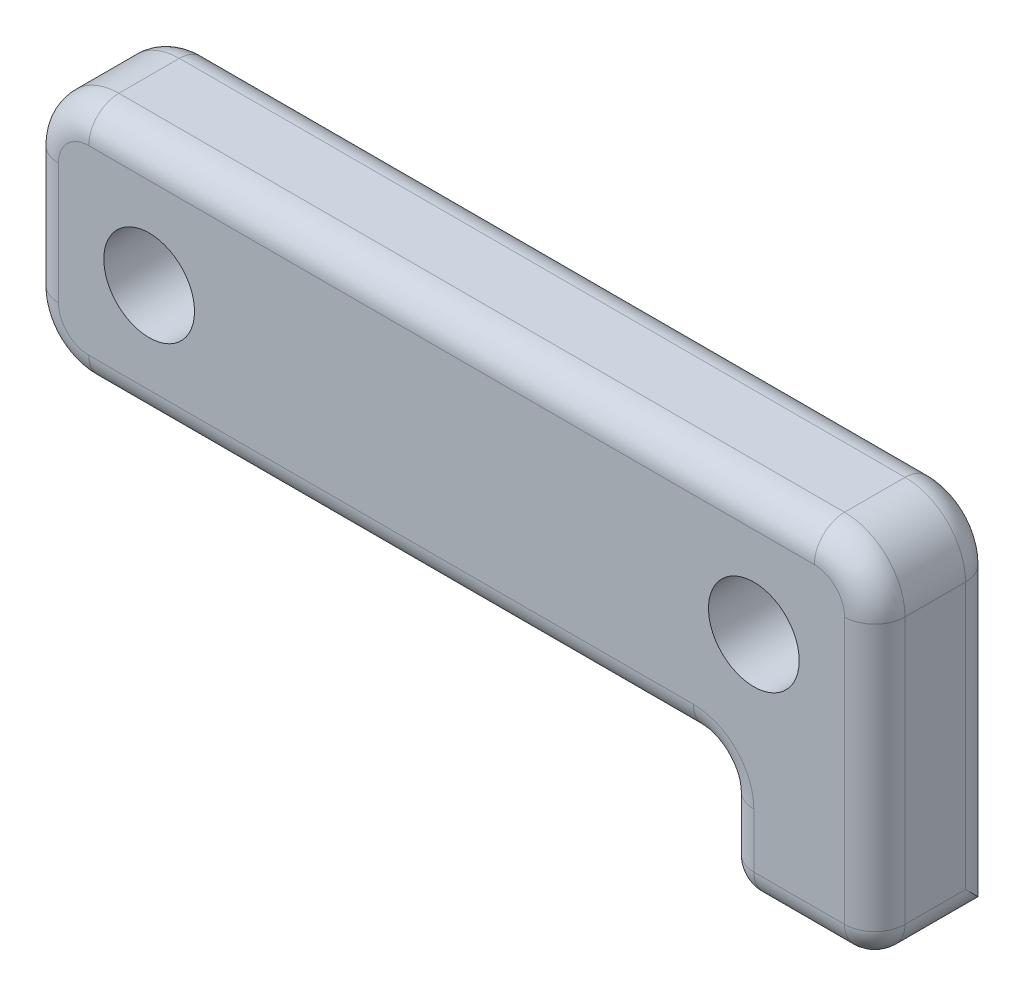
ISO-10303-21;
HEADER;
FILE_DESCRIPTION(('STEP AP214'),'2;1');
FILE_NAME('part.step','',(''),(''),'','','');
FILE_SCHEMA(('AUTOMOTIVE_DESIGN { 1 0 10303 214 1 1 1 1 }'));
ENDSEC;
DATA;
#1=APPLICATION_CONTEXT('core data for automotive mechanical design processes');
#2=APPLICATION_PROTOCOL_DEFINITION('international standard','automotive_design',2000,#1);
#3=PRODUCT_CONTEXT('',#1,'mechanical');
#4=PRODUCT('Part','Part','',(#3));
#5=PRODUCT_RELATED_PRODUCT_CATEGORY('part','',(#4));
#6=PRODUCT_DEFINITION_FORMATION('','',#4);
#7=PRODUCT_DEFINITION_CONTEXT('part definition',#1,'design');
#8=PRODUCT_DEFINITION('design','',#6,#7);
#9=PRODUCT_DEFINITION_SHAPE('','',#8);
#10=(LENGTH_UNIT() NAMED_UNIT(*) SI_UNIT(.MILLI.,.METRE.));
#11=(NAMED_UNIT(*) PLANE_ANGLE_UNIT() SI_UNIT($,.RADIAN.));
#12=(NAMED_UNIT(*) SI_UNIT($,.STERADIAN.) SOLID_ANGLE_UNIT());
#13=UNCERTAINTY_MEASURE_WITH_UNIT(LENGTH_MEASURE(1.E-05),#10,'distance_accuracy_value','');
#14=(GEOMETRIC_REPRESENTATION_CONTEXT(3) GLOBAL_UNCERTAINTY_ASSIGNED_CONTEXT((#13)) GLOBAL_UNIT_ASSIGNED_CONTEXT((#10,
#11,#12)) REPRESENTATION_CONTEXT('',''));
#15=CARTESIAN_POINT('',(0.,0.,0.));
#16=DIRECTION('',(0.,0.,1.));
#17=DIRECTION('',(1.,0.,0.));
#18=AXIS2_PLACEMENT_3D('',#15,#16,#17);
#19=CARTESIAN_POINT('',(1.11353145720165,-7.80553195876444,2.));
#20=DIRECTION('',(0.,-1.,0.));
#21=DIRECTION('',(1.,0.,0.));
#22=AXIS2_PLACEMENT_3D('',#19,#20,#21);
#23=PLANE('',#22);
#24=DIRECTION('',(-1.,0.,0.));
#25=VECTOR('',#24,1.);
#26=CARTESIAN_POINT('',(1.11353145720165,-7.80553195876444,-2.));
#27=LINE('',#26,#25);
#28=CARTESIAN_POINT('',(13.,-7.80553195876444,-2.));
#29=VERTEX_POINT('',#28);
#30=CARTESIAN_POINT('',(12.3,-7.80553195876443,-2.));
#31=VERTEX_POINT('',#30);
#32=EDGE_CURVE('E229',#29,#31,#27,.T.);
#33=ORIENTED_EDGE('',*,*,#32,.F.);
#34=DIRECTION('',(0.,0.,-1.));
#35=VECTOR('',#34,1.);
#36=CARTESIAN_POINT('',(13.,-7.80553195876444,2.));
#37=LINE('',#36,#35);
#38=CARTESIAN_POINT('',(13.,-7.80553195876444,1.));
#39=VERTEX_POINT('',#38);
#40=EDGE_CURVE('E343',#29,#39,#37,.F.);
#41=ORIENTED_EDGE('',*,*,#40,.T.);
#42=DIRECTION('',(-1.,0.,0.));
#43=VECTOR('',#42,1.);
#44=CARTESIAN_POINT('',(1.11353145720165,-7.80553195876444,1.));
#45=LINE('',#44,#43);
#46=CARTESIAN_POINT('',(10.,-7.80553195876444,1.));
#47=VERTEX_POINT('',#46);
#48=EDGE_CURVE('E341',#39,#47,#45,.T.);
#49=ORIENTED_EDGE('',*,*,#48,.T.);
#50=DIRECTION('',(0.,0.,-1.));
#51=VECTOR('',#50,1.);
#52=CARTESIAN_POINT('',(10.,-7.80553195876444,2.));
#53=LINE('',#52,#51);
#54=CARTESIAN_POINT('',(9.99999999999999,-7.80553195876444,-2.));
#55=VERTEX_POINT('',#54);
#56=EDGE_CURVE('E339',#47,#55,#53,.T.);
#57=ORIENTED_EDGE('',*,*,#56,.T.);
#58=CARTESIAN_POINT('',(11.7,-7.80553195876443,-2.));
#59=VERTEX_POINT('',#58);
#60=EDGE_CURVE('E225',#59,#55,#27,.T.);
#61=ORIENTED_EDGE('',*,*,#60,.F.);
#62=DIRECTION('',(0.,0.,-1.));
#63=VECTOR('',#62,1.);
#64=CARTESIAN_POINT('',(11.7,-7.80553195876443,-1.));
#65=LINE('',#64,#63);
#66=CARTESIAN_POINT('',(11.7,-7.80553195876443,-1.));
#67=VERTEX_POINT('',#66);
#68=EDGE_CURVE('E226',#67,#59,#65,.T.);
#69=ORIENTED_EDGE('',*,*,#68,.F.);
#70=DIRECTION('',(-1.,0.,0.));
#71=VECTOR('',#70,1.);
#72=CARTESIAN_POINT('',(1.11353145720165,-7.80553195876444,-1.));
#73=LINE('',#72,#71);
#74=CARTESIAN_POINT('',(12.3,-7.80553195876443,-1.));
#75=VERTEX_POINT('',#74);
#76=EDGE_CURVE('E208',#75,#67,#73,.T.);
#77=ORIENTED_EDGE('',*,*,#76,.F.);
#78=DIRECTION('',(0.,0.,-1.));
#79=VECTOR('',#78,1.);
#80=CARTESIAN_POINT('',(12.3,-7.80553195876443,-1.));
#81=LINE('',#80,#79);
#82=EDGE_CURVE('E231',#75,#31,#81,.T.);
#83=ORIENTED_EDGE('',*,*,#82,.T.);
#84=EDGE_LOOP('',(#33,#41,#49,#57,#61,#69,#77,#83));
#85=FACE_BOUND('',#84,.T.);
#86=ADVANCED_FACE('F34',(#85),#23,.T.);
#87=CARTESIAN_POINT('',(1.11353145720165,-25.2920568815977,-2.));
#88=DIRECTION('',(0.,0.,1.));
#89=DIRECTION('',(1.,0.,0.));
#90=AXIS2_PLACEMENT_3D('',#87,#88,#89);
#91=PLANE('',#90);
#92=ORIENTED_EDGE('',*,*,#60,.T.);
#93=DIRECTION('',(0.,1.,0.));
#94=VECTOR('',#93,1.);
#95=CARTESIAN_POINT('',(10.,-4.,-2.));
#96=LINE('',#95,#94);
#97=CARTESIAN_POINT('',(10.,-5.,-2.));
#98=VERTEX_POINT('',#97);
#99=EDGE_CURVE('E278',#55,#98,#96,.T.);
#100=ORIENTED_EDGE('',*,*,#99,.T.);
#101=CARTESIAN_POINT('',(8.,-5.,-2.));
#102=DIRECTION('',(0.,0.,1.));
#103=DIRECTION('',(1.,0.,0.));
#104=AXIS2_PLACEMENT_3D('',#101,#102,#103);
#105=CIRCLE('',#104,2.);
#106=CARTESIAN_POINT('',(8.,-3.,-2.));
#107=VERTEX_POINT('',#106);
#108=EDGE_CURVE('E275',#107,#98,#105,.F.);
#109=ORIENTED_EDGE('',*,*,#108,.F.);
#110=DIRECTION('',(-1.,0.,0.));
#111=VECTOR('',#110,1.);
#112=CARTESIAN_POINT('',(-12.,-3.,-2.));
#113=LINE('',#112,#111);
#114=CARTESIAN_POINT('',(-12.,-3.,-2.));
#115=VERTEX_POINT('',#114);
#116=EDGE_CURVE('E261',#107,#115,#113,.T.);
#117=ORIENTED_EDGE('',*,*,#116,.T.);
#118=CARTESIAN_POINT('',(-12.,-2.,-2.));
#119=DIRECTION('',(0.,0.,1.));
#120=DIRECTION('',(1.,0.,0.));
#121=AXIS2_PLACEMENT_3D('',#118,#119,#120);
#122=CIRCLE('',#121,1.);
#123=CARTESIAN_POINT('',(-13.,-2.,-2.));
#124=VERTEX_POINT('',#123);
#125=EDGE_CURVE('E263',#115,#124,#122,.F.);
#126=ORIENTED_EDGE('',*,*,#125,.T.);
#127=DIRECTION('',(0.,1.,0.));
#128=VECTOR('',#127,1.);
#129=CARTESIAN_POINT('',(-13.,2.,-2.));
#130=LINE('',#129,#128);
#131=CARTESIAN_POINT('',(-13.,2.,-2.));
#132=VERTEX_POINT('',#131);
#133=EDGE_CURVE('E265',#124,#132,#130,.T.);
#134=ORIENTED_EDGE('',*,*,#133,.T.);
#135=CARTESIAN_POINT('',(-12.,2.,-2.));
#136=DIRECTION('',(0.,0.,1.));
#137=DIRECTION('',(1.,0.,0.));
#138=AXIS2_PLACEMENT_3D('',#135,#136,#137);
#139=CIRCLE('',#138,1.);
#140=CARTESIAN_POINT('',(-12.,3.,-2.));
#141=VERTEX_POINT('',#140);
#142=EDGE_CURVE('E267',#132,#141,#139,.F.);
#143=ORIENTED_EDGE('',*,*,#142,.T.);
#144=DIRECTION('',(1.,0.,0.));
#145=VECTOR('',#144,1.);
#146=CARTESIAN_POINT('',(12.,3.,-2.));
#147=LINE('',#146,#145);
#148=CARTESIAN_POINT('',(12.,3.,-2.));
#149=VERTEX_POINT('',#148);
#150=EDGE_CURVE('E269',#141,#149,#147,.T.);
#151=ORIENTED_EDGE('',*,*,#150,.T.);
#152=CARTESIAN_POINT('',(12.,2.,-2.));
#153=DIRECTION('',(0.,0.,1.));
#154=DIRECTION('',(1.,0.,0.));
#155=AXIS2_PLACEMENT_3D('',#152,#153,#154);
#156=CIRCLE('',#155,0.999999999999999);
#157=CARTESIAN_POINT('',(13.,2.,-2.));
#158=VERTEX_POINT('',#157);
#159=EDGE_CURVE('E271',#149,#158,#156,.F.);
#160=ORIENTED_EDGE('',*,*,#159,.T.);
#161=DIRECTION('',(0.,-1.,0.));
#162=VECTOR('',#161,1.);
#163=CARTESIAN_POINT('',(13.,-7.80553195876443,-2.));
#164=LINE('',#163,#162);
#165=EDGE_CURVE('E273',#158,#29,#164,.T.);
#166=ORIENTED_EDGE('',*,*,#165,.T.);
#167=ORIENTED_EDGE('',*,*,#32,.T.);
#168=DIRECTION('',(0.,-1.,0.));
#169=VECTOR('',#168,1.);
#170=CARTESIAN_POINT('',(12.3,-25.2920568815977,-2.));
#171=LINE('',#170,#169);
#172=CARTESIAN_POINT('',(12.3,0.,-2.));
#173=VERTEX_POINT('',#172);
#174=EDGE_CURVE('E220',#173,#31,#171,.T.);
#175=ORIENTED_EDGE('',*,*,#174,.F.);
#176=CARTESIAN_POINT('',(10.,0.,-2.));
#177=DIRECTION('',(0.,0.,1.));
#178=DIRECTION('',(1.,0.,0.));
#179=AXIS2_PLACEMENT_3D('',#176,#177,#178);
#180=CIRCLE('',#179,2.3);
#181=CARTESIAN_POINT('',(11.7,-1.54919333848296,-2.));
#182=VERTEX_POINT('',#181);
#183=EDGE_CURVE('E421',#173,#182,#180,.T.);
#184=ORIENTED_EDGE('',*,*,#183,.T.);
#185=DIRECTION('',(0.,-1.,0.));
#186=VECTOR('',#185,1.);
#187=CARTESIAN_POINT('',(11.7,-25.2920568815977,-2.));
#188=LINE('',#187,#186);
#189=EDGE_CURVE('E224',#182,#59,#188,.T.);
#190=ORIENTED_EDGE('',*,*,#189,.T.);
#191=EDGE_LOOP('',(#92,#100,#109,#117,#126,#134,#143,#151,#160,#166,#167,#175,#184,#190));
#192=FACE_BOUND('',#191,.T.);
#193=CARTESIAN_POINT('',(-10.,0.,-2.));
#194=DIRECTION('',(0.,0.,1.));
#195=DIRECTION('',(1.,0.,0.));
#196=AXIS2_PLACEMENT_3D('',#193,#194,#195);
#197=CIRCLE('',#196,1.5);
#198=CARTESIAN_POINT('',(-8.5,0.,-2.));
#199=VERTEX_POINT('',#198);
#200=EDGE_CURVE('E239',#199,#199,#197,.T.);
#201=ORIENTED_EDGE('',*,*,#200,.T.);
#202=EDGE_LOOP('',(#201));
#203=FACE_BOUND('',#202,.T.);
#204=ADVANCED_FACE('F465',(#192,#203),#91,.F.);
#205=CARTESIAN_POINT('',(1.11353145720165,-4.,2.));
#206=DIRECTION('',(0.,-1.,0.));
#207=DIRECTION('',(1.,0.,0.));
#208=AXIS2_PLACEMENT_3D('',#205,#206,#207);
#209=PLANE('',#208);
#210=DIRECTION('',(0.,0.,-1.));
#211=VECTOR('',#210,1.);
#212=CARTESIAN_POINT('',(-12.,-4.,2.));
#213=LINE('',#212,#211);
#214=CARTESIAN_POINT('',(-12.,-4.,1.));
#215=VERTEX_POINT('',#214);
#216=CARTESIAN_POINT('',(-12.,-4.,-1.));
#217=VERTEX_POINT('',#216);
#218=EDGE_CURVE('E241',#215,#217,#213,.T.);
#219=ORIENTED_EDGE('',*,*,#218,.T.);
#220=DIRECTION('',(-1.,0.,0.));
#221=VECTOR('',#220,1.);
#222=CARTESIAN_POINT('',(9.,-4.,-1.));
#223=LINE('',#222,#221);
#224=CARTESIAN_POINT('',(8.,-4.,-1.));
#225=VERTEX_POINT('',#224);
#226=EDGE_CURVE('E11',#217,#225,#223,.F.);
#227=ORIENTED_EDGE('',*,*,#226,.T.);
#228=DIRECTION('',(0.,0.,-1.));
#229=VECTOR('',#228,1.);
#230=CARTESIAN_POINT('',(8.,-4.,2.));
#231=LINE('',#230,#229);
#232=CARTESIAN_POINT('',(8.,-4.,1.));
#233=VERTEX_POINT('',#232);
#234=EDGE_CURVE('E50',#225,#233,#231,.F.);
#235=ORIENTED_EDGE('',*,*,#234,.T.);
#236=DIRECTION('',(-1.,0.,0.));
#237=VECTOR('',#236,1.);
#238=CARTESIAN_POINT('',(1.11353145720165,-4.,1.));
#239=LINE('',#238,#237);
#240=EDGE_CURVE('E43',#233,#215,#239,.T.);
#241=ORIENTED_EDGE('',*,*,#240,.T.);
#242=EDGE_LOOP('',(#219,#227,#235,#241));
#243=FACE_BOUND('',#242,.T.);
#244=ADVANCED_FACE('F470',(#243),#209,.T.);
#245=CARTESIAN_POINT('',(9.,-25.2920568815977,2.));
#246=DIRECTION('',(-1.,0.,0.));
#247=DIRECTION('',(0.,0.,1.));
#248=AXIS2_PLACEMENT_3D('',#245,#246,#247);
#249=PLANE('',#248);
#250=DIRECTION('',(0.,1.,0.));
#251=VECTOR('',#250,1.);
#252=CARTESIAN_POINT('',(9.,-7.80553195876443,-1.));
#253=LINE('',#252,#251);
#254=CARTESIAN_POINT('',(9.,-5.,-1.));
#255=VERTEX_POINT('',#254);
#256=CARTESIAN_POINT('',(9.,-6.80553195876444,-1.));
#257=VERTEX_POINT('',#256);
#258=EDGE_CURVE('E285',#255,#257,#253,.F.);
#259=ORIENTED_EDGE('',*,*,#258,.T.);
#260=DIRECTION('',(0.,0.,-1.));
#261=VECTOR('',#260,1.);
#262=CARTESIAN_POINT('',(9.,-6.80553195876444,2.));
#263=LINE('',#262,#261);
#264=CARTESIAN_POINT('',(9.,-6.80553195876444,1.));
#265=VERTEX_POINT('',#264);
#266=EDGE_CURVE('E288',#257,#265,#263,.F.);
#267=ORIENTED_EDGE('',*,*,#266,.T.);
#268=DIRECTION('',(0.,1.,0.));
#269=VECTOR('',#268,1.);
#270=CARTESIAN_POINT('',(9.,-25.2920568815977,1.));
#271=LINE('',#270,#269);
#272=CARTESIAN_POINT('',(9.,-5.,1.));
#273=VERTEX_POINT('',#272);
#274=EDGE_CURVE('E283',#265,#273,#271,.T.);
#275=ORIENTED_EDGE('',*,*,#274,.T.);
#276=DIRECTION('',(0.,0.,-1.));
#277=VECTOR('',#276,1.);
#278=CARTESIAN_POINT('',(9.,-5.,-2.));
#279=LINE('',#278,#277);
#280=EDGE_CURVE('E281',#273,#255,#279,.T.);
#281=ORIENTED_EDGE('',*,*,#280,.T.);
#282=EDGE_LOOP('',(#259,#267,#275,#281));
#283=FACE_BOUND('',#282,.T.);
#284=ADVANCED_FACE('F475',(#283),#249,.T.);
#285=CARTESIAN_POINT('',(14.,-25.2920568815977,2.));
#286=DIRECTION('',(1.,0.,0.));
#287=DIRECTION('',(0.,0.,-1.));
#288=AXIS2_PLACEMENT_3D('',#285,#286,#287);
#289=PLANE('',#288);
#290=DIRECTION('',(0.,0.,-1.));
#291=VECTOR('',#290,1.);
#292=CARTESIAN_POINT('',(14.,-6.80553195876443,2.));
#293=LINE('',#292,#291);
#294=CARTESIAN_POINT('',(14.,-6.80553195876443,1.));
#295=VERTEX_POINT('',#294);
#296=CARTESIAN_POINT('',(14.,-6.80553195876443,-1.));
#297=VERTEX_POINT('',#296);
#298=EDGE_CURVE('E312',#295,#297,#293,.T.);
#299=ORIENTED_EDGE('',*,*,#298,.T.);
#300=DIRECTION('',(0.,-1.,0.));
#301=VECTOR('',#300,1.);
#302=CARTESIAN_POINT('',(14.,2.,-1.));
#303=LINE('',#302,#301);
#304=CARTESIAN_POINT('',(14.,2.,-1.));
#305=VERTEX_POINT('',#304);
#306=EDGE_CURVE('E316',#297,#305,#303,.F.);
#307=ORIENTED_EDGE('',*,*,#306,.T.);
#308=DIRECTION('',(0.,0.,-1.));
#309=VECTOR('',#308,1.);
#310=CARTESIAN_POINT('',(14.,2.,2.));
#311=LINE('',#310,#309);
#312=CARTESIAN_POINT('',(14.,2.,1.));
#313=VERTEX_POINT('',#312);
#314=EDGE_CURVE('E258',#313,#305,#311,.T.);
#315=ORIENTED_EDGE('',*,*,#314,.F.);
#316=DIRECTION('',(0.,-1.,0.));
#317=VECTOR('',#316,1.);
#318=CARTESIAN_POINT('',(14.,-25.2920568815977,1.));
#319=LINE('',#318,#317);
#320=EDGE_CURVE('E314',#313,#295,#319,.T.);
#321=ORIENTED_EDGE('',*,*,#320,.T.);
#322=EDGE_LOOP('',(#299,#307,#315,#321));
#323=FACE_BOUND('',#322,.T.);
#324=ADVANCED_FACE('F473',(#323),#289,.T.);
#325=CARTESIAN_POINT('',(12.,2.,2.));
#326=DIRECTION('',(0.,0.,-1.));
#327=DIRECTION('',(-1.,0.,0.));
#328=AXIS2_PLACEMENT_3D('',#325,#326,#327);
#329=CYLINDRICAL_SURFACE('',#328,2.);
#330=ORIENTED_EDGE('',*,*,#314,.T.);
#331=CARTESIAN_POINT('',(12.,2.,-1.));
#332=DIRECTION('',(0.,0.,1.));
#333=DIRECTION('',(1.,0.,0.));
#334=AXIS2_PLACEMENT_3D('',#331,#332,#333);
#335=CIRCLE('',#334,2.);
#336=CARTESIAN_POINT('',(12.,4.,-1.));
#337=VERTEX_POINT('',#336);
#338=EDGE_CURVE('E321',#305,#337,#335,.T.);
#339=ORIENTED_EDGE('',*,*,#338,.T.);
#340=DIRECTION('',(0.,0.,-1.));
#341=VECTOR('',#340,1.);
#342=CARTESIAN_POINT('',(12.,4.,2.));
#343=LINE('',#342,#341);
#344=CARTESIAN_POINT('',(12.,4.,1.));
#345=VERTEX_POINT('',#344);
#346=EDGE_CURVE('E255',#345,#337,#343,.T.);
#347=ORIENTED_EDGE('',*,*,#346,.F.);
#348=CARTESIAN_POINT('',(12.,2.,1.));
#349=DIRECTION('',(0.,0.,1.));
#350=DIRECTION('',(1.,0.,0.));
#351=AXIS2_PLACEMENT_3D('',#348,#349,#350);
#352=CIRCLE('',#351,2.);
#353=EDGE_CURVE('E319',#345,#313,#352,.F.);
#354=ORIENTED_EDGE('',*,*,#353,.T.);
#355=EDGE_LOOP('',(#330,#339,#347,#354));
#356=FACE_BOUND('',#355,.T.);
#357=ADVANCED_FACE('F597',(#356),#329,.T.);
#358=CARTESIAN_POINT('',(1.11353145720165,4.,2.));
#359=DIRECTION('',(0.,1.,0.));
#360=DIRECTION('',(0.,0.,1.));
#361=AXIS2_PLACEMENT_3D('',#358,#359,#360);
#362=PLANE('',#361);
#363=ORIENTED_EDGE('',*,*,#346,.T.);
#364=DIRECTION('',(1.,0.,0.));
#365=VECTOR('',#364,1.);
#366=CARTESIAN_POINT('',(-12.,4.,-1.));
#367=LINE('',#366,#365);
#368=CARTESIAN_POINT('',(-12.,4.,-1.));
#369=VERTEX_POINT('',#368);
#370=EDGE_CURVE('E325',#337,#369,#367,.F.);
#371=ORIENTED_EDGE('',*,*,#370,.T.);
#372=DIRECTION('',(0.,0.,-1.));
#373=VECTOR('',#372,1.);
#374=CARTESIAN_POINT('',(-12.,4.,2.));
#375=LINE('',#374,#373);
#376=CARTESIAN_POINT('',(-12.,4.,1.));
#377=VERTEX_POINT('',#376);
#378=EDGE_CURVE('E252',#377,#369,#375,.T.);
#379=ORIENTED_EDGE('',*,*,#378,.F.);
#380=DIRECTION('',(1.,0.,0.));
#381=VECTOR('',#380,1.);
#382=CARTESIAN_POINT('',(1.11353145720165,4.,1.));
#383=LINE('',#382,#381);
#384=EDGE_CURVE('E323',#377,#345,#383,.T.);
#385=ORIENTED_EDGE('',*,*,#384,.T.);
#386=EDGE_LOOP('',(#363,#371,#379,#385));
#387=FACE_BOUND('',#386,.T.);
#388=ADVANCED_FACE('F583',(#387),#362,.T.);
#389=CARTESIAN_POINT('',(-12.,2.,2.));
#390=DIRECTION('',(0.,0.,-1.));
#391=DIRECTION('',(-1.,0.,0.));
#392=AXIS2_PLACEMENT_3D('',#389,#390,#391);
#393=CYLINDRICAL_SURFACE('',#392,2.);
#394=ORIENTED_EDGE('',*,*,#378,.T.);
#395=CARTESIAN_POINT('',(-12.,2.,-1.));
#396=DIRECTION('',(0.,0.,1.));
#397=DIRECTION('',(1.,0.,0.));
#398=AXIS2_PLACEMENT_3D('',#395,#396,#397);
#399=CIRCLE('',#398,2.);
#400=CARTESIAN_POINT('',(-14.,2.,-1.));
#401=VERTEX_POINT('',#400);
#402=EDGE_CURVE('E329',#369,#401,#399,.T.);
#403=ORIENTED_EDGE('',*,*,#402,.T.);
#404=DIRECTION('',(0.,0.,-1.));
#405=VECTOR('',#404,1.);
#406=CARTESIAN_POINT('',(-14.,2.,2.));
#407=LINE('',#406,#405);
#408=CARTESIAN_POINT('',(-14.,2.,1.));
#409=VERTEX_POINT('',#408);
#410=EDGE_CURVE('E249',#409,#401,#407,.T.);
#411=ORIENTED_EDGE('',*,*,#410,.F.);
#412=CARTESIAN_POINT('',(-12.,2.,1.));
#413=DIRECTION('',(0.,0.,1.));
#414=DIRECTION('',(1.,0.,0.));
#415=AXIS2_PLACEMENT_3D('',#412,#413,#414);
#416=CIRCLE('',#415,2.);
#417=EDGE_CURVE('E327',#409,#377,#416,.F.);
#418=ORIENTED_EDGE('',*,*,#417,.T.);
#419=EDGE_LOOP('',(#394,#403,#411,#418));
#420=FACE_BOUND('',#419,.T.);
#421=ADVANCED_FACE('F587',(#420),#393,.T.);
#422=CARTESIAN_POINT('',(-14.,-25.2920568815977,2.));
#423=DIRECTION('',(-1.,0.,0.));
#424=DIRECTION('',(0.,-1.,0.));
#425=AXIS2_PLACEMENT_3D('',#422,#423,#424);
#426=PLANE('',#425);
#427=ORIENTED_EDGE('',*,*,#410,.T.);
#428=DIRECTION('',(0.,1.,0.));
#429=VECTOR('',#428,1.);
#430=CARTESIAN_POINT('',(-14.,-2.,-1.));
#431=LINE('',#430,#429);
#432=CARTESIAN_POINT('',(-14.,-2.,-1.));
#433=VERTEX_POINT('',#432);
#434=EDGE_CURVE('E333',#401,#433,#431,.F.);
#435=ORIENTED_EDGE('',*,*,#434,.T.);
#436=DIRECTION('',(0.,0.,-1.));
#437=VECTOR('',#436,1.);
#438=CARTESIAN_POINT('',(-14.,-2.,2.));
#439=LINE('',#438,#437);
#440=CARTESIAN_POINT('',(-14.,-2.,1.));
#441=VERTEX_POINT('',#440);
#442=EDGE_CURVE('E246',#441,#433,#439,.T.);
#443=ORIENTED_EDGE('',*,*,#442,.F.);
#444=DIRECTION('',(0.,1.,0.));
#445=VECTOR('',#444,1.);
#446=CARTESIAN_POINT('',(-14.,-25.2920568815977,1.));
#447=LINE('',#446,#445);
#448=EDGE_CURVE('E331',#441,#409,#447,.T.);
#449=ORIENTED_EDGE('',*,*,#448,.T.);
#450=EDGE_LOOP('',(#427,#435,#443,#449));
#451=FACE_BOUND('',#450,.T.);
#452=ADVANCED_FACE('F620',(#451),#426,.T.);
#453=CARTESIAN_POINT('',(-10.,0.,2.));
#454=DIRECTION('',(0.,0.,-1.));
#455=DIRECTION('',(-1.,0.,0.));
#456=AXIS2_PLACEMENT_3D('',#453,#454,#455);
#457=CYLINDRICAL_SURFACE('',#456,1.5);
#458=CARTESIAN_POINT('',(-10.,0.,2.));
#459=DIRECTION('',(0.,0.,1.));
#460=DIRECTION('',(1.,0.,0.));
#461=AXIS2_PLACEMENT_3D('',#458,#459,#460);
#462=CIRCLE('',#461,1.5);
#463=CARTESIAN_POINT('',(-8.5,0.,2.));
#464=VERTEX_POINT('',#463);
#465=EDGE_CURVE('E235',#464,#464,#462,.T.);
#466=ORIENTED_EDGE('',*,*,#465,.T.);
#467=EDGE_LOOP('',(#466));
#468=FACE_BOUND('',#467,.T.);
#469=ORIENTED_EDGE('',*,*,#200,.F.);
#470=EDGE_LOOP('',(#469));
#471=FACE_BOUND('',#470,.T.);
#472=ADVANCED_FACE('F648',(#468,#471),#457,.F.);
#473=CARTESIAN_POINT('',(-12.,-2.,2.));
#474=DIRECTION('',(0.,0.,-1.));
#475=DIRECTION('',(-1.,0.,0.));
#476=AXIS2_PLACEMENT_3D('',#473,#474,#475);
#477=CYLINDRICAL_SURFACE('',#476,2.);
#478=ORIENTED_EDGE('',*,*,#442,.T.);
#479=CARTESIAN_POINT('',(-12.,-2.,-1.));
#480=DIRECTION('',(0.,0.,1.));
#481=DIRECTION('',(1.,0.,0.));
#482=AXIS2_PLACEMENT_3D('',#479,#480,#481);
#483=CIRCLE('',#482,2.);
#484=EDGE_CURVE('E337',#433,#217,#483,.T.);
#485=ORIENTED_EDGE('',*,*,#484,.T.);
#486=ORIENTED_EDGE('',*,*,#218,.F.);
#487=CARTESIAN_POINT('',(-12.,-2.,1.));
#488=DIRECTION('',(0.,0.,1.));
#489=DIRECTION('',(1.,0.,0.));
#490=AXIS2_PLACEMENT_3D('',#487,#488,#489);
#491=CIRCLE('',#490,2.);
#492=EDGE_CURVE('E335',#215,#441,#491,.F.);
#493=ORIENTED_EDGE('',*,*,#492,.T.);
#494=EDGE_LOOP('',(#478,#485,#486,#493));
#495=FACE_BOUND('',#494,.T.);
#496=ADVANCED_FACE('F451',(#495),#477,.T.);
#497=CARTESIAN_POINT('',(10.,0.,2.));
#498=DIRECTION('',(0.,0.,-1.));
#499=DIRECTION('',(-1.,0.,0.));
#500=AXIS2_PLACEMENT_3D('',#497,#498,#499);
#501=CYLINDRICAL_SURFACE('',#500,1.5);
#502=CARTESIAN_POINT('',(10.,0.,-1.));
#503=DIRECTION('',(0.,0.,1.));
#504=DIRECTION('',(1.,0.,0.));
#505=AXIS2_PLACEMENT_3D('',#502,#503,#504);
#506=CIRCLE('',#505,1.5);
#507=CARTESIAN_POINT('',(11.5,0.,-1.));
#508=VERTEX_POINT('',#507);
#509=EDGE_CURVE('E431',#508,#508,#506,.T.);
#510=ORIENTED_EDGE('',*,*,#509,.F.);
#511=EDGE_LOOP('',(#510));
#512=FACE_BOUND('',#511,.T.);
#513=CARTESIAN_POINT('',(10.,0.,2.));
#514=DIRECTION('',(0.,0.,1.));
#515=DIRECTION('',(1.,0.,0.));
#516=AXIS2_PLACEMENT_3D('',#513,#514,#515);
#517=CIRCLE('',#516,1.5);
#518=CARTESIAN_POINT('',(11.5,0.,2.));
#519=VERTEX_POINT('',#518);
#520=EDGE_CURVE('E238',#519,#519,#517,.T.);
#521=ORIENTED_EDGE('',*,*,#520,.T.);
#522=EDGE_LOOP('',(#521));
#523=FACE_BOUND('',#522,.T.);
#524=ADVANCED_FACE('F447',(#512,#523),#501,.F.);
#525=CARTESIAN_POINT('',(1.11353145720165,-25.2920568815977,2.));
#526=DIRECTION('',(0.,0.,1.));
#527=DIRECTION('',(1.,0.,0.));
#528=AXIS2_PLACEMENT_3D('',#525,#526,#527);
#529=PLANE('',#528);
#530=DIRECTION('',(0.,1.,0.));
#531=VECTOR('',#530,1.);
#532=CARTESIAN_POINT('',(10.,-25.2920568815977,2.));
#533=LINE('',#532,#531);
#534=CARTESIAN_POINT('',(10.,-5.,2.));
#535=VERTEX_POINT('',#534);
#536=CARTESIAN_POINT('',(10.,-6.80553195876444,2.));
#537=VERTEX_POINT('',#536);
#538=EDGE_CURVE('E307',#535,#537,#533,.F.);
#539=ORIENTED_EDGE('',*,*,#538,.T.);
#540=DIRECTION('',(-1.,0.,0.));
#541=VECTOR('',#540,1.);
#542=CARTESIAN_POINT('',(1.11353145720165,-6.80553195876444,2.));
#543=LINE('',#542,#541);
#544=CARTESIAN_POINT('',(13.,-6.80553195876443,2.));
#545=VERTEX_POINT('',#544);
#546=EDGE_CURVE('E310',#537,#545,#543,.F.);
#547=ORIENTED_EDGE('',*,*,#546,.T.);
#548=DIRECTION('',(0.,-1.,0.));
#549=VECTOR('',#548,1.);
#550=CARTESIAN_POINT('',(13.,-25.2920568815977,2.));
#551=LINE('',#550,#549);
#552=CARTESIAN_POINT('',(13.,2.,2.));
#553=VERTEX_POINT('',#552);
#554=EDGE_CURVE('E305',#545,#553,#551,.F.);
#555=ORIENTED_EDGE('',*,*,#554,.T.);
#556=CARTESIAN_POINT('',(12.,2.,2.));
#557=DIRECTION('',(0.,0.,1.));
#558=DIRECTION('',(1.,0.,0.));
#559=AXIS2_PLACEMENT_3D('',#556,#557,#558);
#560=CIRCLE('',#559,0.999999999999999);
#561=CARTESIAN_POINT('',(12.,3.,2.));
#562=VERTEX_POINT('',#561);
#563=EDGE_CURVE('E303',#553,#562,#560,.T.);
#564=ORIENTED_EDGE('',*,*,#563,.T.);
#565=DIRECTION('',(1.,0.,0.));
#566=VECTOR('',#565,1.);
#567=CARTESIAN_POINT('',(1.11353145720165,3.,2.));
#568=LINE('',#567,#566);
#569=CARTESIAN_POINT('',(-12.,3.,2.));
#570=VERTEX_POINT('',#569);
#571=EDGE_CURVE('E301',#562,#570,#568,.F.);
#572=ORIENTED_EDGE('',*,*,#571,.T.);
#573=CARTESIAN_POINT('',(-12.,2.,2.));
#574=DIRECTION('',(0.,0.,1.));
#575=DIRECTION('',(1.,0.,0.));
#576=AXIS2_PLACEMENT_3D('',#573,#574,#575);
#577=CIRCLE('',#576,1.);
#578=CARTESIAN_POINT('',(-13.,2.,2.));
#579=VERTEX_POINT('',#578);
#580=EDGE_CURVE('E299',#570,#579,#577,.T.);
#581=ORIENTED_EDGE('',*,*,#580,.T.);
#582=DIRECTION('',(0.,1.,0.));
#583=VECTOR('',#582,1.);
#584=CARTESIAN_POINT('',(-13.,-25.2920568815977,2.));
#585=LINE('',#584,#583);
#586=CARTESIAN_POINT('',(-13.,-2.,2.));
#587=VERTEX_POINT('',#586);
#588=EDGE_CURVE('E297',#579,#587,#585,.F.);
#589=ORIENTED_EDGE('',*,*,#588,.T.);
#590=CARTESIAN_POINT('',(-12.,-2.,2.));
#591=DIRECTION('',(0.,0.,1.));
#592=DIRECTION('',(1.,0.,0.));
#593=AXIS2_PLACEMENT_3D('',#590,#591,#592);
#594=CIRCLE('',#593,1.);
#595=CARTESIAN_POINT('',(-12.,-3.,2.));
#596=VERTEX_POINT('',#595);
#597=EDGE_CURVE('E295',#587,#596,#594,.T.);
#598=ORIENTED_EDGE('',*,*,#597,.T.);
#599=DIRECTION('',(-1.,0.,0.));
#600=VECTOR('',#599,1.);
#601=CARTESIAN_POINT('',(1.11353145720165,-3.,2.));
#602=LINE('',#601,#600);
#603=CARTESIAN_POINT('',(8.,-3.,2.));
#604=VERTEX_POINT('',#603);
#605=EDGE_CURVE('E293',#596,#604,#602,.F.);
#606=ORIENTED_EDGE('',*,*,#605,.T.);
#607=CARTESIAN_POINT('',(8.,-5.,2.));
#608=DIRECTION('',(0.,0.,1.));
#609=DIRECTION('',(1.,0.,0.));
#610=AXIS2_PLACEMENT_3D('',#607,#608,#609);
#611=CIRCLE('',#610,2.);
#612=EDGE_CURVE('E290',#535,#604,#611,.T.);
#613=ORIENTED_EDGE('',*,*,#612,.F.);
#614=EDGE_LOOP('',(#539,#547,#555,#564,#572,#581,#589,#598,#606,#613));
#615=FACE_BOUND('',#614,.T.);
#616=ORIENTED_EDGE('',*,*,#465,.F.);
#617=EDGE_LOOP('',(#616));
#618=FACE_BOUND('',#617,.T.);
#619=ORIENTED_EDGE('',*,*,#520,.F.);
#620=EDGE_LOOP('',(#619));
#621=FACE_BOUND('',#620,.T.);
#622=ADVANCED_FACE('F450',(#615,#618,#621),#529,.T.);
#623=CARTESIAN_POINT('',(10.,0.,-1.));
#624=DIRECTION('',(0.,0.,-1.));
#625=DIRECTION('',(-1.,0.,0.));
#626=AXIS2_PLACEMENT_3D('',#623,#624,#625);
#627=CYLINDRICAL_SURFACE('',#626,2.3);
#628=ORIENTED_EDGE('',*,*,#183,.F.);
#629=DIRECTION('',(0.,0.,-1.));
#630=VECTOR('',#629,1.);
#631=CARTESIAN_POINT('',(12.3,0.,-1.));
#632=LINE('',#631,#630);
#633=CARTESIAN_POINT('',(12.3,0.,-1.));
#634=VERTEX_POINT('',#633);
#635=EDGE_CURVE('E219',#634,#173,#632,.T.);
#636=ORIENTED_EDGE('',*,*,#635,.F.);
#637=CARTESIAN_POINT('',(10.,0.,-1.));
#638=DIRECTION('',(0.,0.,1.));
#639=DIRECTION('',(1.,0.,0.));
#640=AXIS2_PLACEMENT_3D('',#637,#638,#639);
#641=CIRCLE('',#640,2.3);
#642=CARTESIAN_POINT('',(11.7,-1.54919333848296,-1.));
#643=VERTEX_POINT('',#642);
#644=EDGE_CURVE('E205',#634,#643,#641,.T.);
#645=ORIENTED_EDGE('',*,*,#644,.T.);
#646=DIRECTION('',(0.,0.,-1.));
#647=VECTOR('',#646,1.);
#648=CARTESIAN_POINT('',(11.7,-1.54919333848296,-1.));
#649=LINE('',#648,#647);
#650=EDGE_CURVE('E216',#643,#182,#649,.T.);
#651=ORIENTED_EDGE('',*,*,#650,.T.);
#652=EDGE_LOOP('',(#628,#636,#645,#651));
#653=FACE_BOUND('',#652,.T.);
#654=ADVANCED_FACE('F215',(#653),#627,.F.);
#655=CARTESIAN_POINT('',(11.7,-25.2920568815977,-1.));
#656=DIRECTION('',(1.,0.,0.));
#657=DIRECTION('',(0.,1.,0.));
#658=AXIS2_PLACEMENT_3D('',#655,#656,#657);
#659=PLANE('',#658);
#660=ORIENTED_EDGE('',*,*,#189,.F.);
#661=ORIENTED_EDGE('',*,*,#650,.F.);
#662=DIRECTION('',(0.,-1.,0.));
#663=VECTOR('',#662,1.);
#664=CARTESIAN_POINT('',(11.7,-25.2920568815977,-1.));
#665=LINE('',#664,#663);
#666=EDGE_CURVE('E200',#643,#67,#665,.T.);
#667=ORIENTED_EDGE('',*,*,#666,.T.);
#668=ORIENTED_EDGE('',*,*,#68,.T.);
#669=EDGE_LOOP('',(#660,#661,#667,#668));
#670=FACE_BOUND('',#669,.T.);
#671=ADVANCED_FACE('F222',(#670),#659,.T.);
#672=CARTESIAN_POINT('',(12.3,-25.2920568815977,-1.));
#673=DIRECTION('',(1.,0.,0.));
#674=DIRECTION('',(0.,0.,-1.));
#675=AXIS2_PLACEMENT_3D('',#672,#673,#674);
#676=PLANE('',#675);
#677=ORIENTED_EDGE('',*,*,#174,.T.);
#678=ORIENTED_EDGE('',*,*,#82,.F.);
#679=DIRECTION('',(0.,-1.,0.));
#680=VECTOR('',#679,1.);
#681=CARTESIAN_POINT('',(12.3,-25.2920568815977,-1.));
#682=LINE('',#681,#680);
#683=EDGE_CURVE('E442',#634,#75,#682,.T.);
#684=ORIENTED_EDGE('',*,*,#683,.F.);
#685=ORIENTED_EDGE('',*,*,#635,.T.);
#686=EDGE_LOOP('',(#677,#678,#684,#685));
#687=FACE_BOUND('',#686,.T.);
#688=ADVANCED_FACE('F441',(#687),#676,.F.);
#689=CARTESIAN_POINT('',(1.11353145720165,-25.2920568815977,-1.));
#690=DIRECTION('',(0.,0.,1.));
#691=DIRECTION('',(1.,0.,0.));
#692=AXIS2_PLACEMENT_3D('',#689,#690,#691);
#693=PLANE('',#692);
#694=ORIENTED_EDGE('',*,*,#644,.F.);
#695=ORIENTED_EDGE('',*,*,#683,.T.);
#696=ORIENTED_EDGE('',*,*,#76,.T.);
#697=ORIENTED_EDGE('',*,*,#666,.F.);
#698=EDGE_LOOP('',(#694,#695,#696,#697));
#699=FACE_BOUND('',#698,.T.);
#700=ORIENTED_EDGE('',*,*,#509,.T.);
#701=EDGE_LOOP('',(#700));
#702=FACE_BOUND('',#701,.T.);
#703=ADVANCED_FACE('F202',(#699,#702),#693,.F.);
#704=CARTESIAN_POINT('',(1.11353145720165,3.,1.));
#705=DIRECTION('',(1.,0.,0.));
#706=DIRECTION('',(0.,0.,-1.));
#707=AXIS2_PLACEMENT_3D('',#704,#705,#706);
#708=CYLINDRICAL_SURFACE('',#707,1.);
#709=CARTESIAN_POINT('',(12.,3.,1.));
#710=DIRECTION('',(1.,0.,0.));
#711=DIRECTION('',(0.,0.,-1.));
#712=AXIS2_PLACEMENT_3D('',#709,#710,#711);
#713=CIRCLE('',#712,1.);
#714=EDGE_CURVE('E414',#345,#562,#713,.T.);
#715=ORIENTED_EDGE('',*,*,#714,.F.);
#716=ORIENTED_EDGE('',*,*,#384,.F.);
#717=CARTESIAN_POINT('',(-12.,3.,1.));
#718=DIRECTION('',(-1.,0.,0.));
#719=DIRECTION('',(0.,0.,1.));
#720=AXIS2_PLACEMENT_3D('',#717,#718,#719);
#721=CIRCLE('',#720,1.);
#722=EDGE_CURVE('E38',#570,#377,#721,.T.);
#723=ORIENTED_EDGE('',*,*,#722,.F.);
#724=ORIENTED_EDGE('',*,*,#571,.F.);
#725=EDGE_LOOP('',(#715,#716,#723,#724));
#726=FACE_BOUND('',#725,.T.);
#727=ADVANCED_FACE('F36',(#726),#708,.T.);
#728=CARTESIAN_POINT('',(12.,2.,-1.));
#729=DIRECTION('',(0.,0.,1.));
#730=DIRECTION('',(1.,0.,0.));
#731=AXIS2_PLACEMENT_3D('',#728,#729,#730);
#732=DEGENERATE_TOROIDAL_SURFACE('',#731,0.999999999999999,1.,.T.);
#733=CARTESIAN_POINT('',(12.,3.,-1.));
#734=DIRECTION('',(-1.,0.,0.));
#735=DIRECTION('',(0.,0.,1.));
#736=AXIS2_PLACEMENT_3D('',#733,#734,#735);
#737=CIRCLE('',#736,1.);
#738=EDGE_CURVE('E410',#337,#149,#737,.T.);
#739=ORIENTED_EDGE('',*,*,#738,.F.);
#740=ORIENTED_EDGE('',*,*,#338,.F.);
#741=CARTESIAN_POINT('',(13.,2.,-1.));
#742=DIRECTION('',(0.,-1.,0.));
#743=DIRECTION('',(0.,0.,-1.));
#744=AXIS2_PLACEMENT_3D('',#741,#742,#743);
#745=CIRCLE('',#744,1.);
#746=EDGE_CURVE('E413',#158,#305,#745,.T.);
#747=ORIENTED_EDGE('',*,*,#746,.F.);
#748=ORIENTED_EDGE('',*,*,#159,.F.);
#749=EDGE_LOOP('',(#739,#740,#747,#748));
#750=FACE_BOUND('',#749,.T.);
#751=ADVANCED_FACE('F566',(#750),#732,.T.);
#752=CARTESIAN_POINT('',(-12.,2.,1.));
#753=DIRECTION('',(0.,0.,1.));
#754=DIRECTION('',(1.,0.,0.));
#755=AXIS2_PLACEMENT_3D('',#752,#753,#754);
#756=DEGENERATE_TOROIDAL_SURFACE('',#755,1.,1.,.T.);
#757=ORIENTED_EDGE('',*,*,#722,.T.);
#758=ORIENTED_EDGE('',*,*,#417,.F.);
#759=CARTESIAN_POINT('',(-13.,2.,1.));
#760=DIRECTION('',(0.,-1.,0.));
#761=DIRECTION('',(1.,0.,0.));
#762=AXIS2_PLACEMENT_3D('',#759,#760,#761);
#763=CIRCLE('',#762,1.);
#764=EDGE_CURVE('E407',#579,#409,#763,.T.);
#765=ORIENTED_EDGE('',*,*,#764,.F.);
#766=ORIENTED_EDGE('',*,*,#580,.F.);
#767=EDGE_LOOP('',(#757,#758,#765,#766));
#768=FACE_BOUND('',#767,.T.);
#769=ADVANCED_FACE('F564',(#768),#756,.T.);
#770=CARTESIAN_POINT('',(12.,2.,1.));
#771=DIRECTION('',(0.,0.,1.));
#772=DIRECTION('',(1.,0.,0.));
#773=AXIS2_PLACEMENT_3D('',#770,#771,#772);
#774=DEGENERATE_TOROIDAL_SURFACE('',#773,0.999999999999999,1.,.T.);
#775=ORIENTED_EDGE('',*,*,#714,.T.);
#776=ORIENTED_EDGE('',*,*,#563,.F.);
#777=CARTESIAN_POINT('',(13.,2.,1.));
#778=DIRECTION('',(0.,-1.,0.));
#779=DIRECTION('',(0.,0.,-1.));
#780=AXIS2_PLACEMENT_3D('',#777,#778,#779);
#781=CIRCLE('',#780,1.);
#782=EDGE_CURVE('E404',#313,#553,#781,.T.);
#783=ORIENTED_EDGE('',*,*,#782,.F.);
#784=ORIENTED_EDGE('',*,*,#353,.F.);
#785=EDGE_LOOP('',(#775,#776,#783,#784));
#786=FACE_BOUND('',#785,.T.);
#787=ADVANCED_FACE('F560',(#786),#774,.T.);
#788=CARTESIAN_POINT('',(13.,-25.2920568815977,-1.));
#789=DIRECTION('',(0.,1.,0.));
#790=DIRECTION('',(0.,0.,1.));
#791=AXIS2_PLACEMENT_3D('',#788,#789,#790);
#792=CYLINDRICAL_SURFACE('',#791,1.);
#793=ORIENTED_EDGE('',*,*,#746,.T.);
#794=ORIENTED_EDGE('',*,*,#306,.F.);
#795=CARTESIAN_POINT('',(13.,-6.80553195876443,-1.));
#796=DIRECTION('',(0.,0.707106781186547,-0.707106781186547));
#797=DIRECTION('',(0.,-0.707106781186547,-0.707106781186547));
#798=AXIS2_PLACEMENT_3D('',#795,#796,#797);
#799=ELLIPSE('',#798,1.41421356237309,1.);
#800=EDGE_CURVE('E401',#29,#297,#799,.F.);
#801=ORIENTED_EDGE('',*,*,#800,.F.);
#802=ORIENTED_EDGE('',*,*,#165,.F.);
#803=EDGE_LOOP('',(#793,#794,#801,#802));
#804=FACE_BOUND('',#803,.T.);
#805=ADVANCED_FACE('F556',(#804),#792,.T.);
#806=CARTESIAN_POINT('',(1.11353145720165,3.,-1.));
#807=DIRECTION('',(-1.,0.,0.));
#808=DIRECTION('',(0.,0.,1.));
#809=AXIS2_PLACEMENT_3D('',#806,#807,#808);
#810=CYLINDRICAL_SURFACE('',#809,1.);
#811=ORIENTED_EDGE('',*,*,#738,.T.);
#812=ORIENTED_EDGE('',*,*,#150,.F.);
#813=CARTESIAN_POINT('',(-12.,3.,-1.));
#814=DIRECTION('',(-1.,0.,0.));
#815=DIRECTION('',(0.,0.,1.));
#816=AXIS2_PLACEMENT_3D('',#813,#814,#815);
#817=CIRCLE('',#816,1.);
#818=EDGE_CURVE('E398',#369,#141,#817,.T.);
#819=ORIENTED_EDGE('',*,*,#818,.F.);
#820=ORIENTED_EDGE('',*,*,#370,.F.);
#821=EDGE_LOOP('',(#811,#812,#819,#820));
#822=FACE_BOUND('',#821,.T.);
#823=ADVANCED_FACE('F552',(#822),#810,.T.);
#824=CARTESIAN_POINT('',(-13.,-25.2920568815977,1.));
#825=DIRECTION('',(0.,1.,0.));
#826=DIRECTION('',(-1.,0.,0.));
#827=AXIS2_PLACEMENT_3D('',#824,#825,#826);
#828=CYLINDRICAL_SURFACE('',#827,1.);
#829=ORIENTED_EDGE('',*,*,#764,.T.);
#830=ORIENTED_EDGE('',*,*,#448,.F.);
#831=CARTESIAN_POINT('',(-13.,-2.,1.));
#832=DIRECTION('',(0.,-1.,0.));
#833=DIRECTION('',(0.,0.,-1.));
#834=AXIS2_PLACEMENT_3D('',#831,#832,#833);
#835=CIRCLE('',#834,1.);
#836=EDGE_CURVE('E395',#587,#441,#835,.T.);
#837=ORIENTED_EDGE('',*,*,#836,.F.);
#838=ORIENTED_EDGE('',*,*,#588,.F.);
#839=EDGE_LOOP('',(#829,#830,#837,#838));
#840=FACE_BOUND('',#839,.T.);
#841=ADVANCED_FACE('F548',(#840),#828,.T.);
#842=CARTESIAN_POINT('',(13.,-25.2920568815977,1.));
#843=DIRECTION('',(0.,-1.,0.));
#844=DIRECTION('',(0.,0.,-1.));
#845=AXIS2_PLACEMENT_3D('',#842,#843,#844);
#846=CYLINDRICAL_SURFACE('',#845,1.);
#847=ORIENTED_EDGE('',*,*,#782,.T.);
#848=ORIENTED_EDGE('',*,*,#554,.F.);
#849=CARTESIAN_POINT('',(13.,-6.80553195876443,1.));
#850=DIRECTION('',(0.,-1.,0.));
#851=DIRECTION('',(0.,0.,-1.));
#852=AXIS2_PLACEMENT_3D('',#849,#850,#851);
#853=CIRCLE('',#852,1.);
#854=EDGE_CURVE('E392',#295,#545,#853,.T.);
#855=ORIENTED_EDGE('',*,*,#854,.F.);
#856=ORIENTED_EDGE('',*,*,#320,.F.);
#857=EDGE_LOOP('',(#847,#848,#855,#856));
#858=FACE_BOUND('',#857,.T.);
#859=ADVANCED_FACE('F544',(#858),#846,.T.);
#860=CARTESIAN_POINT('',(13.,-6.80553195876443,2.));
#861=DIRECTION('',(0.,0.,-1.));
#862=DIRECTION('',(-1.,0.,0.));
#863=AXIS2_PLACEMENT_3D('',#860,#861,#862);
#864=CYLINDRICAL_SURFACE('',#863,1.);
#865=ORIENTED_EDGE('',*,*,#800,.T.);
#866=ORIENTED_EDGE('',*,*,#298,.F.);
#867=CARTESIAN_POINT('',(13.,-6.80553195876444,1.));
#868=DIRECTION('',(0.,0.,1.));
#869=DIRECTION('',(1.,0.,0.));
#870=AXIS2_PLACEMENT_3D('',#867,#868,#869);
#871=CIRCLE('',#870,1.);
#872=EDGE_CURVE('E389',#39,#295,#871,.T.);
#873=ORIENTED_EDGE('',*,*,#872,.F.);
#874=ORIENTED_EDGE('',*,*,#40,.F.);
#875=EDGE_LOOP('',(#865,#866,#873,#874));
#876=FACE_BOUND('',#875,.T.);
#877=ADVANCED_FACE('F540',(#876),#864,.T.);
#878=CARTESIAN_POINT('',(-12.,2.,-1.));
#879=DIRECTION('',(0.,0.,1.));
#880=DIRECTION('',(1.,0.,0.));
#881=AXIS2_PLACEMENT_3D('',#878,#879,#880);
#882=DEGENERATE_TOROIDAL_SURFACE('',#881,1.,1.,.T.);
#883=ORIENTED_EDGE('',*,*,#818,.T.);
#884=ORIENTED_EDGE('',*,*,#142,.F.);
#885=CARTESIAN_POINT('',(-13.,2.,-1.));
#886=DIRECTION('',(0.,-1.,0.));
#887=DIRECTION('',(1.,0.,0.));
#888=AXIS2_PLACEMENT_3D('',#885,#886,#887);
#889=CIRCLE('',#888,1.);
#890=EDGE_CURVE('E386',#401,#132,#889,.T.);
#891=ORIENTED_EDGE('',*,*,#890,.F.);
#892=ORIENTED_EDGE('',*,*,#402,.F.);
#893=EDGE_LOOP('',(#883,#884,#891,#892));
#894=FACE_BOUND('',#893,.T.);
#895=ADVANCED_FACE('F536',(#894),#882,.T.);
#896=CARTESIAN_POINT('',(-12.,-2.,1.));
#897=DIRECTION('',(0.,0.,1.));
#898=DIRECTION('',(1.,0.,0.));
#899=AXIS2_PLACEMENT_3D('',#896,#897,#898);
#900=DEGENERATE_TOROIDAL_SURFACE('',#899,1.,1.,.T.);
#901=ORIENTED_EDGE('',*,*,#836,.T.);
#902=ORIENTED_EDGE('',*,*,#492,.F.);
#903=CARTESIAN_POINT('',(-12.,-3.,1.));
#904=DIRECTION('',(1.,0.,0.));
#905=DIRECTION('',(0.,0.,-1.));
#906=AXIS2_PLACEMENT_3D('',#903,#904,#905);
#907=CIRCLE('',#906,1.);
#908=EDGE_CURVE('E383',#596,#215,#907,.T.);
#909=ORIENTED_EDGE('',*,*,#908,.F.);
#910=ORIENTED_EDGE('',*,*,#597,.F.);
#911=EDGE_LOOP('',(#901,#902,#909,#910));
#912=FACE_BOUND('',#911,.T.);
#913=ADVANCED_FACE('F532',(#912),#900,.T.);
#914=CARTESIAN_POINT('',(13.,-6.80553195876444,1.));
#915=DIRECTION('',(0.,0.,1.));
#916=DIRECTION('',(1.,0.,0.));
#917=AXIS2_PLACEMENT_3D('',#914,#915,#916);
#918=SPHERICAL_SURFACE('',#917,1.);
#919=ORIENTED_EDGE('',*,*,#872,.T.);
#920=ORIENTED_EDGE('',*,*,#854,.T.);
#921=CARTESIAN_POINT('',(13.,-6.80553195876443,1.));
#922=DIRECTION('',(1.,0.,0.));
#923=DIRECTION('',(0.,0.,-1.));
#924=AXIS2_PLACEMENT_3D('',#921,#922,#923);
#925=CIRCLE('',#924,1.);
#926=EDGE_CURVE('E380',#39,#545,#925,.F.);
#927=ORIENTED_EDGE('',*,*,#926,.F.);
#928=EDGE_LOOP('',(#919,#920,#927));
#929=FACE_BOUND('',#928,.T.);
#930=ADVANCED_FACE('F528',(#929),#918,.T.);
#931=CARTESIAN_POINT('',(-13.,-25.2920568815977,-1.));
#932=DIRECTION('',(0.,-1.,0.));
#933=DIRECTION('',(1.,0.,0.));
#934=AXIS2_PLACEMENT_3D('',#931,#932,#933);
#935=CYLINDRICAL_SURFACE('',#934,1.);
#936=ORIENTED_EDGE('',*,*,#890,.T.);
#937=ORIENTED_EDGE('',*,*,#133,.F.);
#938=CARTESIAN_POINT('',(-13.,-2.,-1.));
#939=DIRECTION('',(0.,-1.,0.));
#940=DIRECTION('',(0.,0.,-1.));
#941=AXIS2_PLACEMENT_3D('',#938,#939,#940);
#942=CIRCLE('',#941,1.);
#943=EDGE_CURVE('E377',#433,#124,#942,.T.);
#944=ORIENTED_EDGE('',*,*,#943,.F.);
#945=ORIENTED_EDGE('',*,*,#434,.F.);
#946=EDGE_LOOP('',(#936,#937,#944,#945));
#947=FACE_BOUND('',#946,.T.);
#948=ADVANCED_FACE('F524',(#947),#935,.T.);
#949=CARTESIAN_POINT('',(1.11353145720165,-3.,1.));
#950=DIRECTION('',(-1.,0.,0.));
#951=DIRECTION('',(0.,-1.,0.));
#952=AXIS2_PLACEMENT_3D('',#949,#950,#951);
#953=CYLINDRICAL_SURFACE('',#952,1.);
#954=ORIENTED_EDGE('',*,*,#908,.T.);
#955=ORIENTED_EDGE('',*,*,#240,.F.);
#956=CARTESIAN_POINT('',(8.,-3.,1.));
#957=DIRECTION('',(1.,0.,0.));
#958=DIRECTION('',(0.,0.,-1.));
#959=AXIS2_PLACEMENT_3D('',#956,#957,#958);
#960=CIRCLE('',#959,1.);
#961=EDGE_CURVE('E374',#604,#233,#960,.T.);
#962=ORIENTED_EDGE('',*,*,#961,.F.);
#963=ORIENTED_EDGE('',*,*,#605,.F.);
#964=EDGE_LOOP('',(#954,#955,#962,#963));
#965=FACE_BOUND('',#964,.T.);
#966=ADVANCED_FACE('F520',(#965),#953,.T.);
#967=CARTESIAN_POINT('',(10.,-25.2920568815977,1.));
#968=DIRECTION('',(0.,1.,0.));
#969=DIRECTION('',(0.,0.,1.));
#970=AXIS2_PLACEMENT_3D('',#967,#968,#969);
#971=CYLINDRICAL_SURFACE('',#970,1.);
#972=CARTESIAN_POINT('',(10.,-6.80553195876444,1.));
#973=DIRECTION('',(0.,-1.,0.));
#974=DIRECTION('',(0.,0.,-1.));
#975=AXIS2_PLACEMENT_3D('',#972,#973,#974);
#976=CIRCLE('',#975,1.);
#977=EDGE_CURVE('E368',#537,#265,#976,.T.);
#978=ORIENTED_EDGE('',*,*,#977,.F.);
#979=ORIENTED_EDGE('',*,*,#538,.F.);
#980=CARTESIAN_POINT('',(10.,-5.,1.));
#981=DIRECTION('',(0.,1.,0.));
#982=DIRECTION('',(0.,0.,1.));
#983=AXIS2_PLACEMENT_3D('',#980,#981,#982);
#984=CIRCLE('',#983,1.);
#985=EDGE_CURVE('E371',#273,#535,#984,.T.);
#986=ORIENTED_EDGE('',*,*,#985,.F.);
#987=ORIENTED_EDGE('',*,*,#274,.F.);
#988=EDGE_LOOP('',(#978,#979,#986,#987));
#989=FACE_BOUND('',#988,.T.);
#990=ADVANCED_FACE('F516',(#989),#971,.T.);
#991=CARTESIAN_POINT('',(1.11353145720165,-6.80553195876444,1.));
#992=DIRECTION('',(-1.,0.,0.));
#993=DIRECTION('',(0.,-1.,0.));
#994=AXIS2_PLACEMENT_3D('',#991,#992,#993);
#995=CYLINDRICAL_SURFACE('',#994,1.);
#996=ORIENTED_EDGE('',*,*,#926,.T.);
#997=ORIENTED_EDGE('',*,*,#546,.F.);
#998=CARTESIAN_POINT('',(10.,-6.80553195876444,1.));
#999=DIRECTION('',(-1.,0.,0.));
#1000=DIRECTION('',(0.,0.,1.));
#1001=AXIS2_PLACEMENT_3D('',#998,#999,#1000);
#1002=CIRCLE('',#1001,1.);
#1003=EDGE_CURVE('E366',#47,#537,#1002,.T.);
#1004=ORIENTED_EDGE('',*,*,#1003,.F.);
#1005=ORIENTED_EDGE('',*,*,#48,.F.);
#1006=EDGE_LOOP('',(#996,#997,#1004,#1005));
#1007=FACE_BOUND('',#1006,.T.);
#1008=ADVANCED_FACE('F512',(#1007),#995,.T.);
#1009=CARTESIAN_POINT('',(-12.,-2.,-1.));
#1010=DIRECTION('',(0.,0.,1.));
#1011=DIRECTION('',(1.,0.,0.));
#1012=AXIS2_PLACEMENT_3D('',#1009,#1010,#1011);
#1013=DEGENERATE_TOROIDAL_SURFACE('',#1012,1.,1.,.T.);
#1014=ORIENTED_EDGE('',*,*,#943,.T.);
#1015=ORIENTED_EDGE('',*,*,#125,.F.);
#1016=CARTESIAN_POINT('',(-12.,-3.,-1.));
#1017=DIRECTION('',(1.,0.,0.));
#1018=DIRECTION('',(0.,0.,-1.));
#1019=AXIS2_PLACEMENT_3D('',#1016,#1017,#1018);
#1020=CIRCLE('',#1019,1.);
#1021=EDGE_CURVE('E363',#217,#115,#1020,.T.);
#1022=ORIENTED_EDGE('',*,*,#1021,.F.);
#1023=ORIENTED_EDGE('',*,*,#484,.F.);
#1024=EDGE_LOOP('',(#1014,#1015,#1022,#1023));
#1025=FACE_BOUND('',#1024,.T.);
#1026=ADVANCED_FACE('F508',(#1025),#1013,.T.);
#1027=CARTESIAN_POINT('',(8.,-5.,1.));
#1028=DIRECTION('',(0.,0.,1.));
#1029=DIRECTION('',(1.,0.,0.));
#1030=AXIS2_PLACEMENT_3D('',#1027,#1028,#1029);
#1031=TOROIDAL_SURFACE('',#1030,2.,1.);
#1032=ORIENTED_EDGE('',*,*,#612,.T.);
#1033=ORIENTED_EDGE('',*,*,#961,.T.);
#1034=CARTESIAN_POINT('',(8.,-5.,1.));
#1035=DIRECTION('',(0.,0.,1.));
#1036=DIRECTION('',(1.,0.,0.));
#1037=AXIS2_PLACEMENT_3D('',#1034,#1035,#1036);
#1038=CIRCLE('',#1037,1.);
#1039=EDGE_CURVE('E360',#273,#233,#1038,.T.);
#1040=ORIENTED_EDGE('',*,*,#1039,.F.);
#1041=ORIENTED_EDGE('',*,*,#985,.T.);
#1042=EDGE_LOOP('',(#1032,#1033,#1040,#1041));
#1043=FACE_BOUND('',#1042,.T.);
#1044=ADVANCED_FACE('F504',(#1043),#1031,.T.);
#1045=CARTESIAN_POINT('',(10.,-6.80553195876444,1.));
#1046=DIRECTION('',(0.,0.,1.));
#1047=DIRECTION('',(1.,0.,0.));
#1048=AXIS2_PLACEMENT_3D('',#1045,#1046,#1047);
#1049=SPHERICAL_SURFACE('',#1048,1.);
#1050=ORIENTED_EDGE('',*,*,#1003,.T.);
#1051=ORIENTED_EDGE('',*,*,#977,.T.);
#1052=CARTESIAN_POINT('',(10.,-6.80553195876444,1.));
#1053=DIRECTION('',(0.,0.,1.));
#1054=DIRECTION('',(1.,0.,0.));
#1055=AXIS2_PLACEMENT_3D('',#1052,#1053,#1054);
#1056=CIRCLE('',#1055,1.);
#1057=EDGE_CURVE('E357',#47,#265,#1056,.F.);
#1058=ORIENTED_EDGE('',*,*,#1057,.F.);
#1059=EDGE_LOOP('',(#1050,#1051,#1058));
#1060=FACE_BOUND('',#1059,.T.);
#1061=ADVANCED_FACE('F500',(#1060),#1049,.T.);
#1062=CARTESIAN_POINT('',(1.11353145720165,-3.,-1.));
#1063=DIRECTION('',(1.,0.,0.));
#1064=DIRECTION('',(0.,1.,0.));
#1065=AXIS2_PLACEMENT_3D('',#1062,#1063,#1064);
#1066=CYLINDRICAL_SURFACE('',#1065,1.);
#1067=ORIENTED_EDGE('',*,*,#1021,.T.);
#1068=ORIENTED_EDGE('',*,*,#116,.F.);
#1069=CARTESIAN_POINT('',(8.,-3.,-1.));
#1070=DIRECTION('',(1.,0.,0.));
#1071=DIRECTION('',(0.,0.,-1.));
#1072=AXIS2_PLACEMENT_3D('',#1069,#1070,#1071);
#1073=CIRCLE('',#1072,1.);
#1074=EDGE_CURVE('E354',#225,#107,#1073,.T.);
#1075=ORIENTED_EDGE('',*,*,#1074,.F.);
#1076=ORIENTED_EDGE('',*,*,#226,.F.);
#1077=EDGE_LOOP('',(#1067,#1068,#1075,#1076));
#1078=FACE_BOUND('',#1077,.T.);
#1079=ADVANCED_FACE('F496',(#1078),#1066,.T.);
#1080=CARTESIAN_POINT('',(8.,-5.,2.));
#1081=DIRECTION('',(0.,0.,1.));
#1082=DIRECTION('',(1.,0.,0.));
#1083=AXIS2_PLACEMENT_3D('',#1080,#1081,#1082);
#1084=CYLINDRICAL_SURFACE('',#1083,1.);
#1085=ORIENTED_EDGE('',*,*,#1039,.T.);
#1086=ORIENTED_EDGE('',*,*,#234,.F.);
#1087=CARTESIAN_POINT('',(8.,-5.,-1.));
#1088=DIRECTION('',(0.,0.,1.));
#1089=DIRECTION('',(1.,0.,0.));
#1090=AXIS2_PLACEMENT_3D('',#1087,#1088,#1089);
#1091=CIRCLE('',#1090,1.);
#1092=EDGE_CURVE('E351',#255,#225,#1091,.T.);
#1093=ORIENTED_EDGE('',*,*,#1092,.F.);
#1094=ORIENTED_EDGE('',*,*,#280,.F.);
#1095=EDGE_LOOP('',(#1085,#1086,#1093,#1094));
#1096=FACE_BOUND('',#1095,.T.);
#1097=ADVANCED_FACE('F492',(#1096),#1084,.F.);
#1098=CARTESIAN_POINT('',(10.,-6.80553195876444,2.));
#1099=DIRECTION('',(0.,0.,-1.));
#1100=DIRECTION('',(-1.,0.,0.));
#1101=AXIS2_PLACEMENT_3D('',#1098,#1099,#1100);
#1102=CYLINDRICAL_SURFACE('',#1101,1.);
#1103=ORIENTED_EDGE('',*,*,#1057,.T.);
#1104=ORIENTED_EDGE('',*,*,#266,.F.);
#1105=CARTESIAN_POINT('',(10.,-6.80553195876444,-1.));
#1106=DIRECTION('',(0.,0.707106781186547,-0.707106781186547));
#1107=DIRECTION('',(0.,-0.707106781186547,-0.707106781186547));
#1108=AXIS2_PLACEMENT_3D('',#1105,#1106,#1107);
#1109=ELLIPSE('',#1108,1.41421356237309,1.);
#1110=EDGE_CURVE('E349',#55,#257,#1109,.T.);
#1111=ORIENTED_EDGE('',*,*,#1110,.F.);
#1112=ORIENTED_EDGE('',*,*,#56,.F.);
#1113=EDGE_LOOP('',(#1103,#1104,#1111,#1112));
#1114=FACE_BOUND('',#1113,.T.);
#1115=ADVANCED_FACE('F488',(#1114),#1102,.T.);
#1116=CARTESIAN_POINT('',(8.,-5.,-1.));
#1117=DIRECTION('',(0.,0.,1.));
#1118=DIRECTION('',(1.,0.,0.));
#1119=AXIS2_PLACEMENT_3D('',#1116,#1117,#1118);
#1120=TOROIDAL_SURFACE('',#1119,2.,1.);
#1121=ORIENTED_EDGE('',*,*,#1074,.T.);
#1122=ORIENTED_EDGE('',*,*,#108,.T.);
#1123=CARTESIAN_POINT('',(10.,-5.,-1.));
#1124=DIRECTION('',(0.,1.,0.));
#1125=DIRECTION('',(0.,0.,1.));
#1126=AXIS2_PLACEMENT_3D('',#1123,#1124,#1125);
#1127=CIRCLE('',#1126,1.);
#1128=EDGE_CURVE('E347',#255,#98,#1127,.F.);
#1129=ORIENTED_EDGE('',*,*,#1128,.F.);
#1130=ORIENTED_EDGE('',*,*,#1092,.T.);
#1131=EDGE_LOOP('',(#1121,#1122,#1129,#1130));
#1132=FACE_BOUND('',#1131,.T.);
#1133=ADVANCED_FACE('F484',(#1132),#1120,.T.);
#1134=CARTESIAN_POINT('',(10.,-25.2920568815977,-1.));
#1135=DIRECTION('',(0.,-1.,0.));
#1136=DIRECTION('',(0.,0.,-1.));
#1137=AXIS2_PLACEMENT_3D('',#1134,#1135,#1136);
#1138=CYLINDRICAL_SURFACE('',#1137,1.);
#1139=ORIENTED_EDGE('',*,*,#1110,.T.);
#1140=ORIENTED_EDGE('',*,*,#258,.F.);
#1141=ORIENTED_EDGE('',*,*,#1128,.T.);
#1142=ORIENTED_EDGE('',*,*,#99,.F.);
#1143=EDGE_LOOP('',(#1139,#1140,#1141,#1142));
#1144=FACE_BOUND('',#1143,.T.);
#1145=ADVANCED_FACE('F481',(#1144),#1138,.T.);
#1146=CLOSED_SHELL('',(#86,#204,#244,#284,#324,#357,#388,#421,#452,#472,#496,#524,#622,#654,
#671,#688,#703,#727,#751,#769,#787,#805,#823,#841,#859,#877,#895,#913,#930,#948,#966,#990,#1008,
#1026,#1044,#1061,#1079,#1097,#1115,#1133,#1145));
#1147=MANIFOLD_SOLID_BREP('B2',#1146);
#1148=ADVANCED_BREP_SHAPE_REPRESENTATION('',(#18,#1147),#14);
#1149=SHAPE_DEFINITION_REPRESENTATION(#9,#1148);
ENDSEC;
END-ISO-10303-21;
